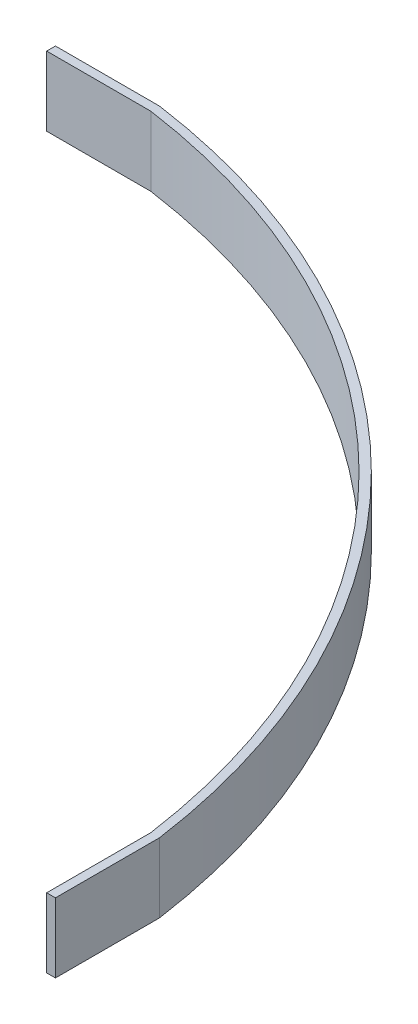
ISO-10303-21;
HEADER;
FILE_DESCRIPTION(('STEP AP214'),'2;1');
FILE_NAME('part.step','',(''),(''),'','','');
FILE_SCHEMA(('AUTOMOTIVE_DESIGN { 1 0 10303 214 1 1 1 1 }'));
ENDSEC;
DATA;
#1=APPLICATION_CONTEXT('core data for automotive mechanical design processes');
#2=APPLICATION_PROTOCOL_DEFINITION('international standard','automotive_design',2000,#1);
#3=PRODUCT_CONTEXT('',#1,'mechanical');
#4=PRODUCT('Part','Part','',(#3));
#5=PRODUCT_RELATED_PRODUCT_CATEGORY('part','',(#4));
#6=PRODUCT_DEFINITION_FORMATION('','',#4);
#7=PRODUCT_DEFINITION_CONTEXT('part definition',#1,'design');
#8=PRODUCT_DEFINITION('design','',#6,#7);
#9=PRODUCT_DEFINITION_SHAPE('','',#8);
#10=(LENGTH_UNIT() NAMED_UNIT(*) SI_UNIT(.MILLI.,.METRE.));
#11=(NAMED_UNIT(*) PLANE_ANGLE_UNIT() SI_UNIT($,.RADIAN.));
#12=(NAMED_UNIT(*) SI_UNIT($,.STERADIAN.) SOLID_ANGLE_UNIT());
#13=UNCERTAINTY_MEASURE_WITH_UNIT(LENGTH_MEASURE(1.E-05),#10,'distance_accuracy_value','');
#14=(GEOMETRIC_REPRESENTATION_CONTEXT(3) GLOBAL_UNCERTAINTY_ASSIGNED_CONTEXT((#13)) GLOBAL_UNIT_ASSIGNED_CONTEXT((#10,
#11,#12)) REPRESENTATION_CONTEXT('',''));
#15=CARTESIAN_POINT('',(0.,0.,0.));
#16=DIRECTION('',(0.,0.,1.));
#17=DIRECTION('',(1.,0.,0.));
#18=AXIS2_PLACEMENT_3D('',#15,#16,#17);
#19=CARTESIAN_POINT('',(0.,12.7,0.));
#20=DIRECTION('',(0.,-1.,0.));
#21=DIRECTION('',(0.,0.,-1.));
#22=AXIS2_PLACEMENT_3D('',#19,#20,#21);
#23=CYLINDRICAL_SURFACE('',#22,136.291341816037);
#24=CARTESIAN_POINT('',(0.,0.,0.));
#25=DIRECTION('',(0.,1.,0.));
#26=DIRECTION('',(0.,0.,1.));
#27=AXIS2_PLACEMENT_3D('',#24,#25,#26);
#28=CIRCLE('',#27,136.291341816037);
#29=CARTESIAN_POINT('',(19.0500000000001,0.,-134.953426610872));
#30=VERTEX_POINT('',#29);
#31=CARTESIAN_POINT('',(134.953426610872,0.,-19.05));
#32=VERTEX_POINT('',#31);
#33=EDGE_CURVE('E127',#30,#32,#28,.F.);
#34=ORIENTED_EDGE('',*,*,#33,.F.);
#35=DIRECTION('',(0.,-1.,0.));
#36=VECTOR('',#35,1.);
#37=CARTESIAN_POINT('',(19.0500000000001,12.7,-134.953426610872));
#38=LINE('',#37,#36);
#39=CARTESIAN_POINT('',(19.0500000000001,12.7,-134.953426610872));
#40=VERTEX_POINT('',#39);
#41=EDGE_CURVE('E11',#40,#30,#38,.T.);
#42=ORIENTED_EDGE('',*,*,#41,.F.);
#43=CARTESIAN_POINT('',(0.,12.7,0.));
#44=DIRECTION('',(0.,1.,0.));
#45=DIRECTION('',(0.,0.,1.));
#46=AXIS2_PLACEMENT_3D('',#43,#44,#45);
#47=CIRCLE('',#46,136.291341816037);
#48=CARTESIAN_POINT('',(134.953426610872,12.7,-19.05));
#49=VERTEX_POINT('',#48);
#50=EDGE_CURVE('E147',#40,#49,#47,.F.);
#51=ORIENTED_EDGE('',*,*,#50,.T.);
#52=DIRECTION('',(0.,-1.,0.));
#53=VECTOR('',#52,1.);
#54=CARTESIAN_POINT('',(134.953426610872,12.7,-19.05));
#55=LINE('',#54,#53);
#56=EDGE_CURVE('E51',#49,#32,#55,.T.);
#57=ORIENTED_EDGE('',*,*,#56,.T.);
#58=EDGE_LOOP('',(#34,#42,#51,#57));
#59=FACE_BOUND('',#58,.T.);
#60=ADVANCED_FACE('F35',(#59),#23,.T.);
#61=CARTESIAN_POINT('',(0.,12.7,-134.953426610872));
#62=DIRECTION('',(0.,0.,-1.));
#63=DIRECTION('',(-1.,0.,0.));
#64=AXIS2_PLACEMENT_3D('',#61,#62,#63);
#65=PLANE('',#64);
#66=DIRECTION('',(1.,0.,0.));
#67=VECTOR('',#66,1.);
#68=CARTESIAN_POINT('',(0.,0.,-134.953426610872));
#69=LINE('',#68,#67);
#70=CARTESIAN_POINT('',(0.,0.,-134.953426610872));
#71=VERTEX_POINT('',#70);
#72=EDGE_CURVE('E129',#71,#30,#69,.T.);
#73=ORIENTED_EDGE('',*,*,#72,.F.);
#74=DIRECTION('',(0.,-1.,0.));
#75=VECTOR('',#74,1.);
#76=CARTESIAN_POINT('',(0.,12.7,-134.953426610872));
#77=LINE('',#76,#75);
#78=CARTESIAN_POINT('',(0.,12.7,-134.953426610872));
#79=VERTEX_POINT('',#78);
#80=EDGE_CURVE('E43',#79,#71,#77,.T.);
#81=ORIENTED_EDGE('',*,*,#80,.F.);
#82=DIRECTION('',(1.,0.,0.));
#83=VECTOR('',#82,1.);
#84=CARTESIAN_POINT('',(0.,12.7,-134.953426610872));
#85=LINE('',#84,#83);
#86=EDGE_CURVE('E175',#79,#40,#85,.T.);
#87=ORIENTED_EDGE('',*,*,#86,.T.);
#88=ORIENTED_EDGE('',*,*,#41,.T.);
#89=EDGE_LOOP('',(#73,#81,#87,#88));
#90=FACE_BOUND('',#89,.T.);
#91=ADVANCED_FACE('F164',(#90),#65,.T.);
#92=CARTESIAN_POINT('',(0.,12.7,0.));
#93=DIRECTION('',(-1.,0.,0.));
#94=DIRECTION('',(0.,0.,1.));
#95=AXIS2_PLACEMENT_3D('',#92,#93,#94);
#96=PLANE('',#95);
#97=DIRECTION('',(0.,0.,-1.));
#98=VECTOR('',#97,1.);
#99=CARTESIAN_POINT('',(0.,0.,0.));
#100=LINE('',#99,#98);
#101=CARTESIAN_POINT('',(0.,0.,-133.35));
#102=VERTEX_POINT('',#101);
#103=EDGE_CURVE('E132',#102,#71,#100,.T.);
#104=ORIENTED_EDGE('',*,*,#103,.F.);
#105=DIRECTION('',(0.,-1.,0.));
#106=VECTOR('',#105,1.);
#107=CARTESIAN_POINT('',(0.,12.7,-133.35));
#108=LINE('',#107,#106);
#109=CARTESIAN_POINT('',(0.,12.7,-133.35));
#110=VERTEX_POINT('',#109);
#111=EDGE_CURVE('E153',#110,#102,#108,.T.);
#112=ORIENTED_EDGE('',*,*,#111,.F.);
#113=DIRECTION('',(0.,0.,-1.));
#114=VECTOR('',#113,1.);
#115=CARTESIAN_POINT('',(0.,12.7,0.));
#116=LINE('',#115,#114);
#117=EDGE_CURVE('E160',#110,#79,#116,.T.);
#118=ORIENTED_EDGE('',*,*,#117,.T.);
#119=ORIENTED_EDGE('',*,*,#80,.T.);
#120=EDGE_LOOP('',(#104,#112,#118,#119));
#121=FACE_BOUND('',#120,.T.);
#122=ADVANCED_FACE('F158',(#121),#96,.T.);
#123=CARTESIAN_POINT('',(0.,12.7,-133.35));
#124=DIRECTION('',(0.,0.,-1.));
#125=DIRECTION('',(-1.,0.,0.));
#126=AXIS2_PLACEMENT_3D('',#123,#124,#125);
#127=PLANE('',#126);
#128=DIRECTION('',(1.,0.,0.));
#129=VECTOR('',#128,1.);
#130=CARTESIAN_POINT('',(0.,0.,-133.35));
#131=LINE('',#130,#129);
#132=CARTESIAN_POINT('',(19.05,0.,-133.35));
#133=VERTEX_POINT('',#132);
#134=EDGE_CURVE('E135',#102,#133,#131,.T.);
#135=ORIENTED_EDGE('',*,*,#134,.T.);
#136=DIRECTION('',(0.,-1.,0.));
#137=VECTOR('',#136,1.);
#138=CARTESIAN_POINT('',(19.05,12.7,-133.35));
#139=LINE('',#138,#137);
#140=CARTESIAN_POINT('',(19.05,12.7,-133.35));
#141=VERTEX_POINT('',#140);
#142=EDGE_CURVE('E151',#141,#133,#139,.T.);
#143=ORIENTED_EDGE('',*,*,#142,.F.);
#144=DIRECTION('',(1.,0.,0.));
#145=VECTOR('',#144,1.);
#146=CARTESIAN_POINT('',(0.,12.7,-133.35));
#147=LINE('',#146,#145);
#148=EDGE_CURVE('E173',#110,#141,#147,.T.);
#149=ORIENTED_EDGE('',*,*,#148,.F.);
#150=ORIENTED_EDGE('',*,*,#111,.T.);
#151=EDGE_LOOP('',(#135,#143,#149,#150));
#152=FACE_BOUND('',#151,.T.);
#153=ADVANCED_FACE('F171',(#152),#127,.F.);
#154=CARTESIAN_POINT('',(0.,12.7,0.));
#155=DIRECTION('',(0.,-1.,0.));
#156=DIRECTION('',(0.,0.,-1.));
#157=AXIS2_PLACEMENT_3D('',#154,#155,#156);
#158=CYLINDRICAL_SURFACE('',#157,134.703841816037);
#159=CARTESIAN_POINT('',(0.,0.,0.));
#160=DIRECTION('',(0.,1.,0.));
#161=DIRECTION('',(0.,0.,1.));
#162=AXIS2_PLACEMENT_3D('',#159,#160,#161);
#163=CIRCLE('',#162,134.703841816037);
#164=CARTESIAN_POINT('',(133.35,0.,-19.05));
#165=VERTEX_POINT('',#164);
#166=EDGE_CURVE('E138',#165,#133,#163,.T.);
#167=ORIENTED_EDGE('',*,*,#166,.F.);
#168=DIRECTION('',(0.,-1.,0.));
#169=VECTOR('',#168,1.);
#170=CARTESIAN_POINT('',(133.35,12.7,-19.05));
#171=LINE('',#170,#169);
#172=CARTESIAN_POINT('',(133.35,12.7,-19.05));
#173=VERTEX_POINT('',#172);
#174=EDGE_CURVE('E110',#173,#165,#171,.T.);
#175=ORIENTED_EDGE('',*,*,#174,.F.);
#176=CARTESIAN_POINT('',(0.,12.7,0.));
#177=DIRECTION('',(0.,1.,0.));
#178=DIRECTION('',(0.,0.,1.));
#179=AXIS2_PLACEMENT_3D('',#176,#177,#178);
#180=CIRCLE('',#179,134.703841816037);
#181=EDGE_CURVE('E119',#173,#141,#180,.T.);
#182=ORIENTED_EDGE('',*,*,#181,.T.);
#183=ORIENTED_EDGE('',*,*,#142,.T.);
#184=EDGE_LOOP('',(#167,#175,#182,#183));
#185=FACE_BOUND('',#184,.T.);
#186=ADVANCED_FACE('F180',(#185),#158,.F.);
#187=CARTESIAN_POINT('',(133.35,12.7,0.));
#188=DIRECTION('',(-1.,0.,0.));
#189=DIRECTION('',(0.,0.,1.));
#190=AXIS2_PLACEMENT_3D('',#187,#188,#189);
#191=PLANE('',#190);
#192=DIRECTION('',(0.,0.,-1.));
#193=VECTOR('',#192,1.);
#194=CARTESIAN_POINT('',(133.35,0.,0.));
#195=LINE('',#194,#193);
#196=CARTESIAN_POINT('',(133.35,0.,0.));
#197=VERTEX_POINT('',#196);
#198=EDGE_CURVE('E106',#197,#165,#195,.T.);
#199=ORIENTED_EDGE('',*,*,#198,.F.);
#200=DIRECTION('',(0.,-1.,0.));
#201=VECTOR('',#200,1.);
#202=CARTESIAN_POINT('',(133.35,12.7,0.));
#203=LINE('',#202,#201);
#204=CARTESIAN_POINT('',(133.35,12.7,0.));
#205=VERTEX_POINT('',#204);
#206=EDGE_CURVE('E101',#205,#197,#203,.T.);
#207=ORIENTED_EDGE('',*,*,#206,.F.);
#208=DIRECTION('',(0.,0.,-1.));
#209=VECTOR('',#208,1.);
#210=CARTESIAN_POINT('',(133.35,12.7,0.));
#211=LINE('',#210,#209);
#212=EDGE_CURVE('E104',#205,#173,#211,.T.);
#213=ORIENTED_EDGE('',*,*,#212,.T.);
#214=ORIENTED_EDGE('',*,*,#174,.T.);
#215=EDGE_LOOP('',(#199,#207,#213,#214));
#216=FACE_BOUND('',#215,.T.);
#217=ADVANCED_FACE('F103',(#216),#191,.T.);
#218=CARTESIAN_POINT('',(0.,12.7,-1.14215506728249E-13));
#219=DIRECTION('',(0.,0.,1.));
#220=DIRECTION('',(1.,0.,0.));
#221=AXIS2_PLACEMENT_3D('',#218,#219,#220);
#222=PLANE('',#221);
#223=DIRECTION('',(-1.,0.,0.));
#224=VECTOR('',#223,1.);
#225=CARTESIAN_POINT('',(0.,0.,-1.14215506728249E-13));
#226=LINE('',#225,#224);
#227=CARTESIAN_POINT('',(134.953426610872,0.,0.));
#228=VERTEX_POINT('',#227);
#229=EDGE_CURVE('E142',#228,#197,#226,.T.);
#230=ORIENTED_EDGE('',*,*,#229,.F.);
#231=DIRECTION('',(0.,-1.,0.));
#232=VECTOR('',#231,1.);
#233=CARTESIAN_POINT('',(134.953426610872,12.7,0.));
#234=LINE('',#233,#232);
#235=CARTESIAN_POINT('',(134.953426610872,12.7,0.));
#236=VERTEX_POINT('',#235);
#237=EDGE_CURVE('E76',#236,#228,#234,.T.);
#238=ORIENTED_EDGE('',*,*,#237,.F.);
#239=DIRECTION('',(-1.,0.,0.));
#240=VECTOR('',#239,1.);
#241=CARTESIAN_POINT('',(0.,12.7,-1.14215506728249E-13));
#242=LINE('',#241,#240);
#243=EDGE_CURVE('E117',#236,#205,#242,.T.);
#244=ORIENTED_EDGE('',*,*,#243,.T.);
#245=ORIENTED_EDGE('',*,*,#206,.T.);
#246=EDGE_LOOP('',(#230,#238,#244,#245));
#247=FACE_BOUND('',#246,.T.);
#248=ADVANCED_FACE('F121',(#247),#222,.T.);
#249=CARTESIAN_POINT('',(134.953426610872,12.7,0.));
#250=DIRECTION('',(1.,0.,0.));
#251=DIRECTION('',(0.,0.,-1.));
#252=AXIS2_PLACEMENT_3D('',#249,#250,#251);
#253=PLANE('',#252);
#254=DIRECTION('',(0.,0.,1.));
#255=VECTOR('',#254,1.);
#256=CARTESIAN_POINT('',(134.953426610872,0.,0.));
#257=LINE('',#256,#255);
#258=EDGE_CURVE('E144',#32,#228,#257,.T.);
#259=ORIENTED_EDGE('',*,*,#258,.F.);
#260=ORIENTED_EDGE('',*,*,#56,.F.);
#261=DIRECTION('',(0.,0.,1.));
#262=VECTOR('',#261,1.);
#263=CARTESIAN_POINT('',(134.953426610872,12.7,0.));
#264=LINE('',#263,#262);
#265=EDGE_CURVE('E122',#49,#236,#264,.T.);
#266=ORIENTED_EDGE('',*,*,#265,.T.);
#267=ORIENTED_EDGE('',*,*,#237,.T.);
#268=EDGE_LOOP('',(#259,#260,#266,#267));
#269=FACE_BOUND('',#268,.T.);
#270=ADVANCED_FACE('F181',(#269),#253,.T.);
#271=CARTESIAN_POINT('',(0.,12.7,0.));
#272=DIRECTION('',(0.,1.,0.));
#273=DIRECTION('',(0.,0.,1.));
#274=AXIS2_PLACEMENT_3D('',#271,#272,#273);
#275=PLANE('',#274);
#276=ORIENTED_EDGE('',*,*,#50,.F.);
#277=ORIENTED_EDGE('',*,*,#86,.F.);
#278=ORIENTED_EDGE('',*,*,#117,.F.);
#279=ORIENTED_EDGE('',*,*,#148,.T.);
#280=ORIENTED_EDGE('',*,*,#181,.F.);
#281=ORIENTED_EDGE('',*,*,#212,.F.);
#282=ORIENTED_EDGE('',*,*,#243,.F.);
#283=ORIENTED_EDGE('',*,*,#265,.F.);
#284=EDGE_LOOP('',(#276,#277,#278,#279,#280,#281,#282,#283));
#285=FACE_BOUND('',#284,.T.);
#286=ADVANCED_FACE('F115',(#285),#275,.T.);
#287=CARTESIAN_POINT('',(0.,0.,0.));
#288=DIRECTION('',(0.,1.,0.));
#289=DIRECTION('',(0.,0.,1.));
#290=AXIS2_PLACEMENT_3D('',#287,#288,#289);
#291=PLANE('',#290);
#292=ORIENTED_EDGE('',*,*,#33,.T.);
#293=ORIENTED_EDGE('',*,*,#258,.T.);
#294=ORIENTED_EDGE('',*,*,#229,.T.);
#295=ORIENTED_EDGE('',*,*,#198,.T.);
#296=ORIENTED_EDGE('',*,*,#166,.T.);
#297=ORIENTED_EDGE('',*,*,#134,.F.);
#298=ORIENTED_EDGE('',*,*,#103,.T.);
#299=ORIENTED_EDGE('',*,*,#72,.T.);
#300=EDGE_LOOP('',(#292,#293,#294,#295,#296,#297,#298,#299));
#301=FACE_BOUND('',#300,.T.);
#302=ADVANCED_FACE('F167',(#301),#291,.F.);
#303=CLOSED_SHELL('',(#60,#91,#122,#153,#186,#217,#248,#270,#286,#302));
#304=MANIFOLD_SOLID_BREP('B2',#303);
#305=ADVANCED_BREP_SHAPE_REPRESENTATION('',(#18,#304),#14);
#306=SHAPE_DEFINITION_REPRESENTATION(#9,#305);
ENDSEC;
END-ISO-10303-21;
